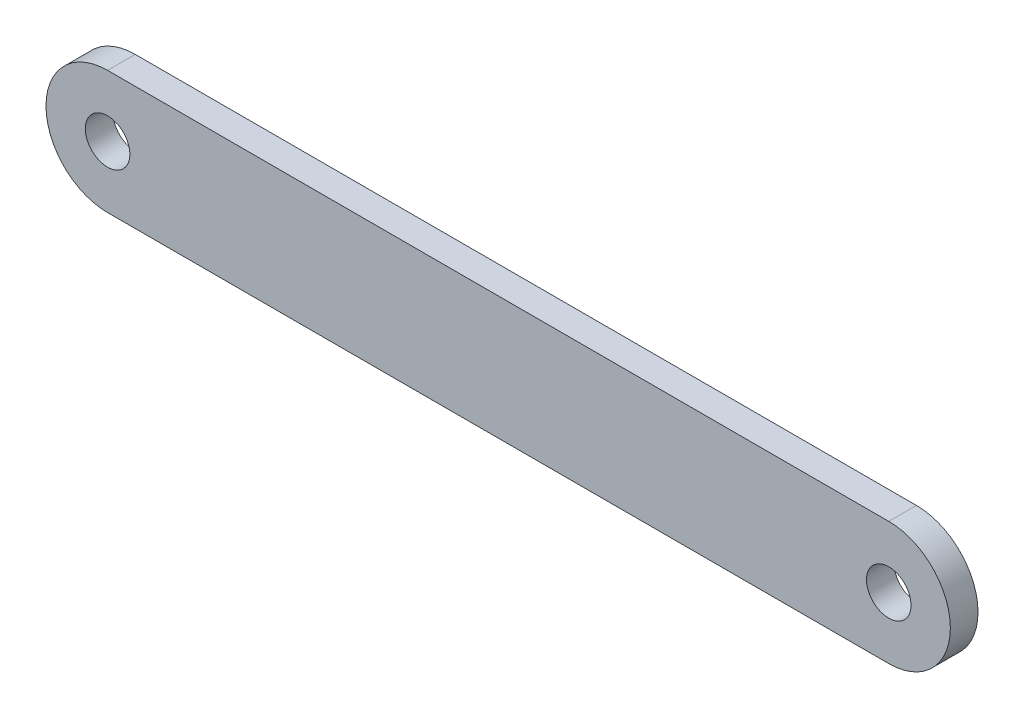
ISO-10303-21;
HEADER;
FILE_DESCRIPTION(('STEP AP214'),'2;1');
FILE_NAME('part.step','',(''),(''),'','','');
FILE_SCHEMA(('AUTOMOTIVE_DESIGN { 1 0 10303 214 1 1 1 1 }'));
ENDSEC;
DATA;
#1=APPLICATION_CONTEXT('core data for automotive mechanical design processes');
#2=APPLICATION_PROTOCOL_DEFINITION('international standard','automotive_design',2000,#1);
#3=PRODUCT_CONTEXT('',#1,'mechanical');
#4=PRODUCT('Part','Part','',(#3));
#5=PRODUCT_RELATED_PRODUCT_CATEGORY('part','',(#4));
#6=PRODUCT_DEFINITION_FORMATION('','',#4);
#7=PRODUCT_DEFINITION_CONTEXT('part definition',#1,'design');
#8=PRODUCT_DEFINITION('design','',#6,#7);
#9=PRODUCT_DEFINITION_SHAPE('','',#8);
#10=(LENGTH_UNIT() NAMED_UNIT(*) SI_UNIT(.MILLI.,.METRE.));
#11=(NAMED_UNIT(*) PLANE_ANGLE_UNIT() SI_UNIT($,.RADIAN.));
#12=(NAMED_UNIT(*) SI_UNIT($,.STERADIAN.) SOLID_ANGLE_UNIT());
#13=UNCERTAINTY_MEASURE_WITH_UNIT(LENGTH_MEASURE(1.E-05),#10,'distance_accuracy_value','');
#14=(GEOMETRIC_REPRESENTATION_CONTEXT(3) GLOBAL_UNCERTAINTY_ASSIGNED_CONTEXT((#13)) GLOBAL_UNIT_ASSIGNED_CONTEXT((#10,
#11,#12)) REPRESENTATION_CONTEXT('',''));
#15=CARTESIAN_POINT('',(0.,0.,0.));
#16=DIRECTION('',(0.,0.,1.));
#17=DIRECTION('',(1.,0.,0.));
#18=AXIS2_PLACEMENT_3D('',#15,#16,#17);
#19=CARTESIAN_POINT('',(0.,0.,2.11));
#20=DIRECTION('',(0.,0.,1.));
#21=DIRECTION('',(1.,0.,0.));
#22=AXIS2_PLACEMENT_3D('',#19,#20,#21);
#23=PLANE('',#22);
#24=CARTESIAN_POINT('',(0.,0.,2.11));
#25=DIRECTION('',(0.,0.,1.));
#26=DIRECTION('',(1.,0.,0.));
#27=AXIS2_PLACEMENT_3D('',#24,#25,#26);
#28=CIRCLE('',#27,1.7);
#29=CARTESIAN_POINT('',(1.7,0.,2.11));
#30=VERTEX_POINT('',#29);
#31=EDGE_CURVE('E99',#30,#30,#28,.T.);
#32=ORIENTED_EDGE('',*,*,#31,.F.);
#33=EDGE_LOOP('',(#32));
#34=FACE_BOUND('',#33,.T.);
#35=CARTESIAN_POINT('',(0.,0.,2.11));
#36=DIRECTION('',(0.,0.,1.));
#37=DIRECTION('',(1.,0.,0.));
#38=AXIS2_PLACEMENT_3D('',#35,#36,#37);
#39=CIRCLE('',#38,4.7);
#40=CARTESIAN_POINT('',(0.,4.7,2.11));
#41=VERTEX_POINT('',#40);
#42=CARTESIAN_POINT('',(0.,-4.7,2.11));
#43=VERTEX_POINT('',#42);
#44=EDGE_CURVE('E84',#41,#43,#39,.T.);
#45=ORIENTED_EDGE('',*,*,#44,.T.);
#46=DIRECTION('',(1.,0.,0.));
#47=VECTOR('',#46,1.);
#48=CARTESIAN_POINT('',(0.,-4.7,2.11));
#49=LINE('',#48,#47);
#50=CARTESIAN_POINT('',(59.61,-4.7,2.11));
#51=VERTEX_POINT('',#50);
#52=EDGE_CURVE('E79',#43,#51,#49,.T.);
#53=ORIENTED_EDGE('',*,*,#52,.T.);
#54=CARTESIAN_POINT('',(59.61,0.,2.11));
#55=DIRECTION('',(0.,0.,1.));
#56=DIRECTION('',(1.,0.,0.));
#57=AXIS2_PLACEMENT_3D('',#54,#55,#56);
#58=CIRCLE('',#57,4.7);
#59=CARTESIAN_POINT('',(59.61,4.7,2.11));
#60=VERTEX_POINT('',#59);
#61=EDGE_CURVE('E82',#51,#60,#58,.T.);
#62=ORIENTED_EDGE('',*,*,#61,.T.);
#63=DIRECTION('',(-1.,0.,0.));
#64=VECTOR('',#63,1.);
#65=CARTESIAN_POINT('',(0.,4.7,2.11));
#66=LINE('',#65,#64);
#67=EDGE_CURVE('E49',#60,#41,#66,.T.);
#68=ORIENTED_EDGE('',*,*,#67,.T.);
#69=EDGE_LOOP('',(#45,#53,#62,#68));
#70=FACE_BOUND('',#69,.T.);
#71=CARTESIAN_POINT('',(59.61,0.,2.11));
#72=DIRECTION('',(0.,0.,1.));
#73=DIRECTION('',(-1.,0.,0.));
#74=AXIS2_PLACEMENT_3D('',#71,#72,#73);
#75=CIRCLE('',#74,1.7);
#76=CARTESIAN_POINT('',(57.91,0.,2.11));
#77=VERTEX_POINT('',#76);
#78=EDGE_CURVE('E114',#77,#77,#75,.T.);
#79=ORIENTED_EDGE('',*,*,#78,.F.);
#80=EDGE_LOOP('',(#79));
#81=FACE_BOUND('',#80,.T.);
#82=ADVANCED_FACE('F32',(#34,#70,#81),#23,.T.);
#83=CARTESIAN_POINT('',(0.,0.,0.));
#84=DIRECTION('',(0.,0.,1.));
#85=DIRECTION('',(1.,0.,0.));
#86=AXIS2_PLACEMENT_3D('',#83,#84,#85);
#87=PLANE('',#86);
#88=CARTESIAN_POINT('',(0.,0.,0.));
#89=DIRECTION('',(0.,0.,1.));
#90=DIRECTION('',(1.,0.,0.));
#91=AXIS2_PLACEMENT_3D('',#88,#89,#90);
#92=CIRCLE('',#91,4.7);
#93=CARTESIAN_POINT('',(0.,4.7,0.));
#94=VERTEX_POINT('',#93);
#95=CARTESIAN_POINT('',(0.,-4.7,0.));
#96=VERTEX_POINT('',#95);
#97=EDGE_CURVE('E96',#94,#96,#92,.T.);
#98=ORIENTED_EDGE('',*,*,#97,.F.);
#99=DIRECTION('',(-1.,0.,0.));
#100=VECTOR('',#99,1.);
#101=CARTESIAN_POINT('',(0.,4.7,0.));
#102=LINE('',#101,#100);
#103=CARTESIAN_POINT('',(59.61,4.7,0.));
#104=VERTEX_POINT('',#103);
#105=EDGE_CURVE('E72',#104,#94,#102,.T.);
#106=ORIENTED_EDGE('',*,*,#105,.F.);
#107=CARTESIAN_POINT('',(59.61,0.,0.));
#108=DIRECTION('',(0.,0.,1.));
#109=DIRECTION('',(1.,0.,0.));
#110=AXIS2_PLACEMENT_3D('',#107,#108,#109);
#111=CIRCLE('',#110,4.7);
#112=CARTESIAN_POINT('',(59.61,-4.7,0.));
#113=VERTEX_POINT('',#112);
#114=EDGE_CURVE('E66',#113,#104,#111,.T.);
#115=ORIENTED_EDGE('',*,*,#114,.F.);
#116=DIRECTION('',(1.,0.,0.));
#117=VECTOR('',#116,1.);
#118=CARTESIAN_POINT('',(0.,-4.7,0.));
#119=LINE('',#118,#117);
#120=EDGE_CURVE('E88',#96,#113,#119,.T.);
#121=ORIENTED_EDGE('',*,*,#120,.F.);
#122=EDGE_LOOP('',(#98,#106,#115,#121));
#123=FACE_BOUND('',#122,.T.);
#124=CARTESIAN_POINT('',(0.,0.,0.));
#125=DIRECTION('',(0.,0.,1.));
#126=DIRECTION('',(1.,0.,0.));
#127=AXIS2_PLACEMENT_3D('',#124,#125,#126);
#128=CIRCLE('',#127,1.7);
#129=CARTESIAN_POINT('',(1.7,0.,0.));
#130=VERTEX_POINT('',#129);
#131=EDGE_CURVE('E111',#130,#130,#128,.T.);
#132=ORIENTED_EDGE('',*,*,#131,.T.);
#133=EDGE_LOOP('',(#132));
#134=FACE_BOUND('',#133,.T.);
#135=CARTESIAN_POINT('',(59.61,0.,0.));
#136=DIRECTION('',(0.,0.,1.));
#137=DIRECTION('',(-1.,0.,0.));
#138=AXIS2_PLACEMENT_3D('',#135,#136,#137);
#139=CIRCLE('',#138,1.7);
#140=CARTESIAN_POINT('',(57.91,0.,0.));
#141=VERTEX_POINT('',#140);
#142=EDGE_CURVE('E117',#141,#141,#139,.T.);
#143=ORIENTED_EDGE('',*,*,#142,.T.);
#144=EDGE_LOOP('',(#143));
#145=FACE_BOUND('',#144,.T.);
#146=ADVANCED_FACE('F107',(#123,#134,#145),#87,.F.);
#147=CARTESIAN_POINT('',(0.,0.,2.11));
#148=DIRECTION('',(0.,0.,-1.));
#149=DIRECTION('',(-1.,0.,0.));
#150=AXIS2_PLACEMENT_3D('',#147,#148,#149);
#151=CYLINDRICAL_SURFACE('',#150,4.7);
#152=ORIENTED_EDGE('',*,*,#97,.T.);
#153=DIRECTION('',(0.,0.,-1.));
#154=VECTOR('',#153,1.);
#155=CARTESIAN_POINT('',(0.,-4.7,2.11));
#156=LINE('',#155,#154);
#157=EDGE_CURVE('E11',#43,#96,#156,.T.);
#158=ORIENTED_EDGE('',*,*,#157,.F.);
#159=ORIENTED_EDGE('',*,*,#44,.F.);
#160=DIRECTION('',(0.,0.,-1.));
#161=VECTOR('',#160,1.);
#162=CARTESIAN_POINT('',(0.,4.7,2.11));
#163=LINE('',#162,#161);
#164=EDGE_CURVE('E92',#41,#94,#163,.T.);
#165=ORIENTED_EDGE('',*,*,#164,.T.);
#166=EDGE_LOOP('',(#152,#158,#159,#165));
#167=FACE_BOUND('',#166,.T.);
#168=ADVANCED_FACE('F34',(#167),#151,.T.);
#169=CARTESIAN_POINT('',(0.,-4.7,2.11));
#170=DIRECTION('',(0.,1.,0.));
#171=DIRECTION('',(0.,0.,1.));
#172=AXIS2_PLACEMENT_3D('',#169,#170,#171);
#173=PLANE('',#172);
#174=ORIENTED_EDGE('',*,*,#120,.T.);
#175=DIRECTION('',(0.,0.,-1.));
#176=VECTOR('',#175,1.);
#177=CARTESIAN_POINT('',(59.61,-4.7,2.11));
#178=LINE('',#177,#176);
#179=EDGE_CURVE('E41',#51,#113,#178,.T.);
#180=ORIENTED_EDGE('',*,*,#179,.F.);
#181=ORIENTED_EDGE('',*,*,#52,.F.);
#182=ORIENTED_EDGE('',*,*,#157,.T.);
#183=EDGE_LOOP('',(#174,#180,#181,#182));
#184=FACE_BOUND('',#183,.T.);
#185=ADVANCED_FACE('F87',(#184),#173,.F.);
#186=CARTESIAN_POINT('',(59.61,0.,2.11));
#187=DIRECTION('',(0.,0.,-1.));
#188=DIRECTION('',(-1.,0.,0.));
#189=AXIS2_PLACEMENT_3D('',#186,#187,#188);
#190=CYLINDRICAL_SURFACE('',#189,4.7);
#191=ORIENTED_EDGE('',*,*,#114,.T.);
#192=DIRECTION('',(0.,0.,-1.));
#193=VECTOR('',#192,1.);
#194=CARTESIAN_POINT('',(59.61,4.7,2.11));
#195=LINE('',#194,#193);
#196=EDGE_CURVE('E89',#60,#104,#195,.T.);
#197=ORIENTED_EDGE('',*,*,#196,.F.);
#198=ORIENTED_EDGE('',*,*,#61,.F.);
#199=ORIENTED_EDGE('',*,*,#179,.T.);
#200=EDGE_LOOP('',(#191,#197,#198,#199));
#201=FACE_BOUND('',#200,.T.);
#202=ADVANCED_FACE('F90',(#201),#190,.T.);
#203=CARTESIAN_POINT('',(0.,4.7,2.11));
#204=DIRECTION('',(0.,-1.,0.));
#205=DIRECTION('',(0.,0.,-1.));
#206=AXIS2_PLACEMENT_3D('',#203,#204,#205);
#207=PLANE('',#206);
#208=ORIENTED_EDGE('',*,*,#105,.T.);
#209=ORIENTED_EDGE('',*,*,#164,.F.);
#210=ORIENTED_EDGE('',*,*,#67,.F.);
#211=ORIENTED_EDGE('',*,*,#196,.T.);
#212=EDGE_LOOP('',(#208,#209,#210,#211));
#213=FACE_BOUND('',#212,.T.);
#214=ADVANCED_FACE('F104',(#213),#207,.F.);
#215=CARTESIAN_POINT('',(0.,0.,2.11));
#216=DIRECTION('',(0.,0.,-1.));
#217=DIRECTION('',(-1.,0.,0.));
#218=AXIS2_PLACEMENT_3D('',#215,#216,#217);
#219=CYLINDRICAL_SURFACE('',#218,1.7);
#220=ORIENTED_EDGE('',*,*,#31,.T.);
#221=EDGE_LOOP('',(#220));
#222=FACE_BOUND('',#221,.T.);
#223=ORIENTED_EDGE('',*,*,#131,.F.);
#224=EDGE_LOOP('',(#223));
#225=FACE_BOUND('',#224,.T.);
#226=ADVANCED_FACE('F134',(#222,#225),#219,.F.);
#227=CARTESIAN_POINT('',(59.61,0.,2.11));
#228=DIRECTION('',(0.,0.,-1.));
#229=DIRECTION('',(-1.,0.,0.));
#230=AXIS2_PLACEMENT_3D('',#227,#228,#229);
#231=CYLINDRICAL_SURFACE('',#230,1.7);
#232=ORIENTED_EDGE('',*,*,#78,.T.);
#233=EDGE_LOOP('',(#232));
#234=FACE_BOUND('',#233,.T.);
#235=ORIENTED_EDGE('',*,*,#142,.F.);
#236=EDGE_LOOP('',(#235));
#237=FACE_BOUND('',#236,.T.);
#238=ADVANCED_FACE('F123',(#234,#237),#231,.F.);
#239=CLOSED_SHELL('',(#82,#146,#168,#185,#202,#214,#226,#238));
#240=MANIFOLD_SOLID_BREP('B2',#239);
#241=ADVANCED_BREP_SHAPE_REPRESENTATION('',(#18,#240),#14);
#242=SHAPE_DEFINITION_REPRESENTATION(#9,#241);
ENDSEC;
END-ISO-10303-21;
